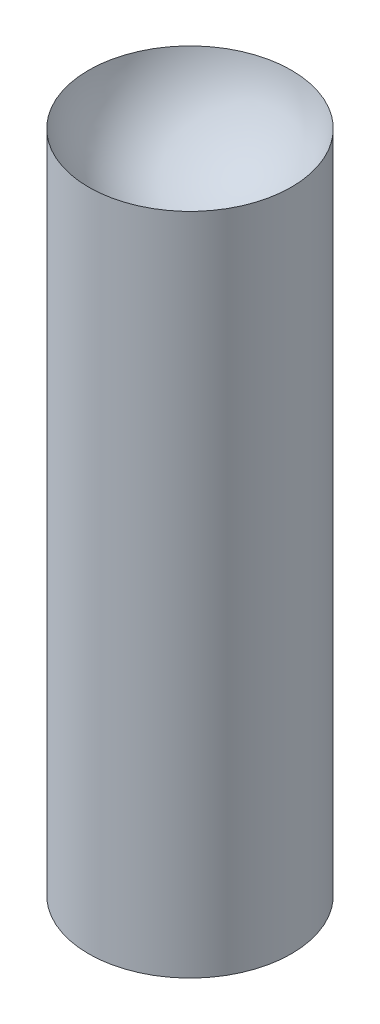
ISO-10303-21;
HEADER;
FILE_DESCRIPTION(('STEP AP214'),'2;1');
FILE_NAME('part.step','',(''),(''),'','','');
FILE_SCHEMA(('AUTOMOTIVE_DESIGN { 1 0 10303 214 1 1 1 1 }'));
ENDSEC;
DATA;
#1=APPLICATION_CONTEXT('core data for automotive mechanical design processes');
#2=APPLICATION_PROTOCOL_DEFINITION('international standard','automotive_design',2000,#1);
#3=PRODUCT_CONTEXT('',#1,'mechanical');
#4=PRODUCT('Part','Part','',(#3));
#5=PRODUCT_RELATED_PRODUCT_CATEGORY('part','',(#4));
#6=PRODUCT_DEFINITION_FORMATION('','',#4);
#7=PRODUCT_DEFINITION_CONTEXT('part definition',#1,'design');
#8=PRODUCT_DEFINITION('design','',#6,#7);
#9=PRODUCT_DEFINITION_SHAPE('','',#8);
#10=(LENGTH_UNIT() NAMED_UNIT(*) SI_UNIT(.MILLI.,.METRE.));
#11=(NAMED_UNIT(*) PLANE_ANGLE_UNIT() SI_UNIT($,.RADIAN.));
#12=(NAMED_UNIT(*) SI_UNIT($,.STERADIAN.) SOLID_ANGLE_UNIT());
#13=UNCERTAINTY_MEASURE_WITH_UNIT(LENGTH_MEASURE(1.E-05),#10,'distance_accuracy_value','');
#14=(GEOMETRIC_REPRESENTATION_CONTEXT(3) GLOBAL_UNCERTAINTY_ASSIGNED_CONTEXT((#13)) GLOBAL_UNIT_ASSIGNED_CONTEXT((#10,
#11,#12)) REPRESENTATION_CONTEXT('',''));
#15=CARTESIAN_POINT('',(0.,0.,0.));
#16=DIRECTION('',(0.,0.,1.));
#17=DIRECTION('',(1.,0.,0.));
#18=AXIS2_PLACEMENT_3D('',#15,#16,#17);
#19=CARTESIAN_POINT('',(0.,63.5,0.));
#20=DIRECTION('',(0.,-1.,0.));
#21=DIRECTION('',(0.,0.,-1.));
#22=AXIS2_PLACEMENT_3D('',#19,#20,#21);
#23=CYLINDRICAL_SURFACE('',#22,9.5);
#24=CARTESIAN_POINT('',(0.,0.,0.));
#25=DIRECTION('',(0.,1.,0.));
#26=DIRECTION('',(0.,0.,1.));
#27=AXIS2_PLACEMENT_3D('',#24,#25,#26);
#28=CIRCLE('',#27,9.5);
#29=CARTESIAN_POINT('',(0.,0.,9.5));
#30=VERTEX_POINT('',#29);
#31=EDGE_CURVE('E11',#30,#30,#28,.T.);
#32=ORIENTED_EDGE('',*,*,#31,.T.);
#33=EDGE_LOOP('',(#32));
#34=FACE_BOUND('',#33,.T.);
#35=CARTESIAN_POINT('',(-6.51702857131792E-13,62.2320308883339,0.));
#36=DIRECTION('',(0.,-1.,0.));
#37=DIRECTION('',(1.,0.,0.));
#38=AXIS2_PLACEMENT_3D('',#35,#36,#37);
#39=CIRCLE('',#38,9.49999999999935);
#40=CARTESIAN_POINT('',(9.4999999999987,62.232030888334,0.));
#41=VERTEX_POINT('',#40);
#42=EDGE_CURVE('E43',#41,#41,#39,.F.);
#43=ORIENTED_EDGE('',*,*,#42,.F.);
#44=EDGE_LOOP('',(#43));
#45=FACE_BOUND('',#44,.T.);
#46=ADVANCED_FACE('F40',(#34,#45),#23,.T.);
#47=CARTESIAN_POINT('',(0.,0.,0.));
#48=DIRECTION('',(0.,1.,0.));
#49=DIRECTION('',(0.,0.,1.));
#50=AXIS2_PLACEMENT_3D('',#47,#48,#49);
#51=PLANE('',#50);
#52=ORIENTED_EDGE('',*,*,#31,.F.);
#53=EDGE_LOOP('',(#52));
#54=FACE_BOUND('',#53,.T.);
#55=ADVANCED_FACE('F53',(#54),#51,.F.);
#56=CARTESIAN_POINT('',(-9.65200000000067,64.1790744915656,0.));
#57=CARTESIAN_POINT('',(-9.63658983873513,57.2556425542214,0.));
#58=CARTESIAN_POINT('',(-4.40787806304133,54.0582780614501,0.));
#59=CARTESIAN_POINT('',(-5.6749568262928E-13,54.1790744915657,0.));
#60=B_SPLINE_CURVE_WITH_KNOTS('',3,(#56,#57,#58,#59),.UNSPECIFIED.,.F.,.F.,(4,4),(0.,1.),.UNSPECIFIED.);
#61=CARTESIAN_POINT('',(-5.66760894549792E-13,54.1790744915657,0.));
#62=DIRECTION('',(0.,-1.,0.));
#63=AXIS1_PLACEMENT('',#61,#62);
#64=SURFACE_OF_REVOLUTION('',#60,#63);
#65=CARTESIAN_POINT('',(-5.6749568262928E-13,54.1790744915657,0.));
#66=VERTEX_POINT('',#65);
#67=VERTEX_LOOP('',#66);
#68=FACE_BOUND('',#67,.T.);
#69=ORIENTED_EDGE('',*,*,#42,.T.);
#70=EDGE_LOOP('',(#69));
#71=FACE_BOUND('',#70,.T.);
#72=ADVANCED_FACE('F50',(#68,#71),#64,.F.);
#73=CLOSED_SHELL('',(#46,#55,#72));
#74=MANIFOLD_SOLID_BREP('B2',#73);
#75=ADVANCED_BREP_SHAPE_REPRESENTATION('',(#18,#74),#14);
#76=SHAPE_DEFINITION_REPRESENTATION(#9,#75);
ENDSEC;
END-ISO-10303-21;
